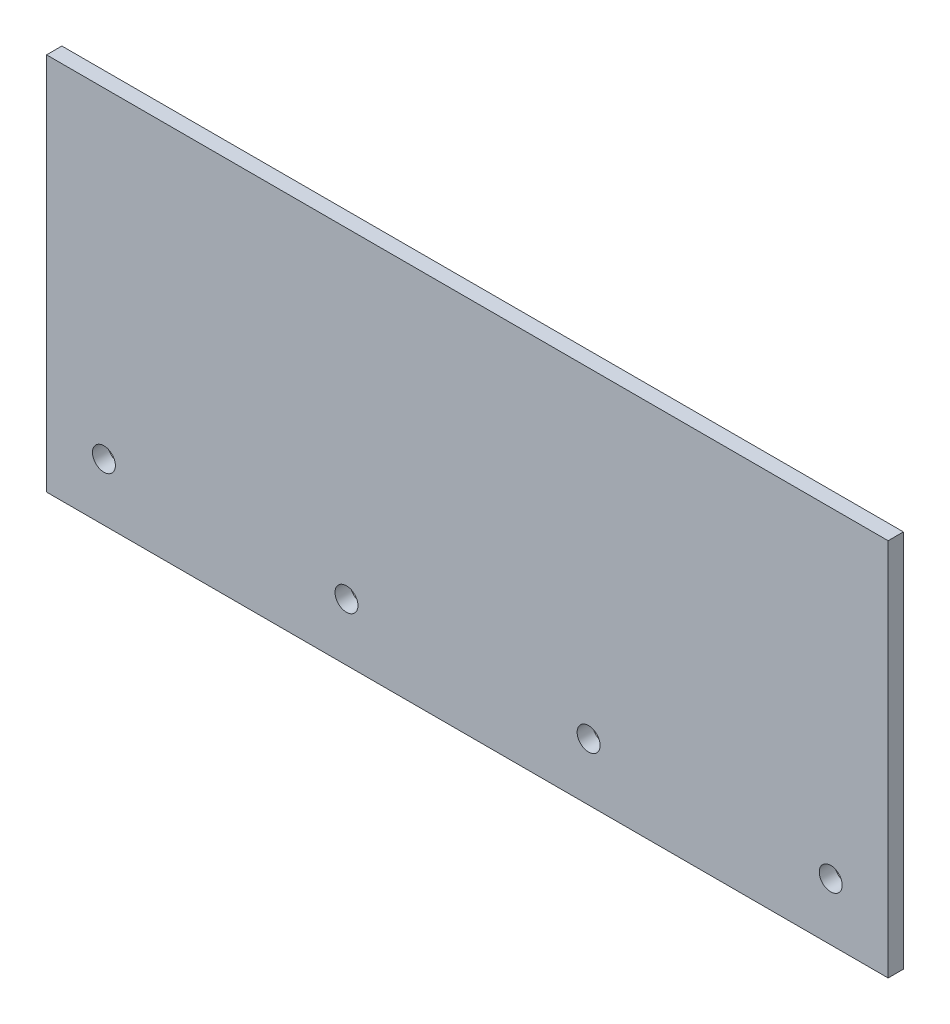
ISO-10303-21;
HEADER;
FILE_DESCRIPTION(('STEP AP214'),'2;1');
FILE_NAME('part.step','',(''),(''),'','','');
FILE_SCHEMA(('AUTOMOTIVE_DESIGN { 1 0 10303 214 1 1 1 1 }'));
ENDSEC;
DATA;
#1=APPLICATION_CONTEXT('core data for automotive mechanical design processes');
#2=APPLICATION_PROTOCOL_DEFINITION('international standard','automotive_design',2000,#1);
#3=PRODUCT_CONTEXT('',#1,'mechanical');
#4=PRODUCT('Part','Part','',(#3));
#5=PRODUCT_RELATED_PRODUCT_CATEGORY('part','',(#4));
#6=PRODUCT_DEFINITION_FORMATION('','',#4);
#7=PRODUCT_DEFINITION_CONTEXT('part definition',#1,'design');
#8=PRODUCT_DEFINITION('design','',#6,#7);
#9=PRODUCT_DEFINITION_SHAPE('','',#8);
#10=(LENGTH_UNIT() NAMED_UNIT(*) SI_UNIT(.MILLI.,.METRE.));
#11=(NAMED_UNIT(*) PLANE_ANGLE_UNIT() SI_UNIT($,.RADIAN.));
#12=(NAMED_UNIT(*) SI_UNIT($,.STERADIAN.) SOLID_ANGLE_UNIT());
#13=UNCERTAINTY_MEASURE_WITH_UNIT(LENGTH_MEASURE(1.E-05),#10,'distance_accuracy_value','');
#14=(GEOMETRIC_REPRESENTATION_CONTEXT(3) GLOBAL_UNCERTAINTY_ASSIGNED_CONTEXT((#13)) GLOBAL_UNIT_ASSIGNED_CONTEXT((#10,
#11,#12)) REPRESENTATION_CONTEXT('',''));
#15=CARTESIAN_POINT('',(0.,0.,0.));
#16=DIRECTION('',(0.,0.,1.));
#17=DIRECTION('',(1.,0.,0.));
#18=AXIS2_PLACEMENT_3D('',#15,#16,#17);
#19=CARTESIAN_POINT('',(0.,0.,4.));
#20=DIRECTION('',(0.,0.,-1.));
#21=DIRECTION('',(-1.,0.,0.));
#22=AXIS2_PLACEMENT_3D('',#19,#20,#21);
#23=PLANE('',#22);
#24=DIRECTION('',(0.,1.,0.));
#25=VECTOR('',#24,1.);
#26=CARTESIAN_POINT('',(220.,0.,4.));
#27=LINE('',#26,#25);
#28=CARTESIAN_POINT('',(220.,0.,4.));
#29=VERTEX_POINT('',#28);
#30=CARTESIAN_POINT('',(220.,99.,4.));
#31=VERTEX_POINT('',#30);
#32=EDGE_CURVE('E85',#29,#31,#27,.T.);
#33=ORIENTED_EDGE('',*,*,#32,.T.);
#34=DIRECTION('',(-1.,0.,0.));
#35=VECTOR('',#34,1.);
#36=CARTESIAN_POINT('',(0.,99.,4.));
#37=LINE('',#36,#35);
#38=CARTESIAN_POINT('',(0.,99.,4.));
#39=VERTEX_POINT('',#38);
#40=EDGE_CURVE('E80',#31,#39,#37,.T.);
#41=ORIENTED_EDGE('',*,*,#40,.T.);
#42=DIRECTION('',(0.,-1.,0.));
#43=VECTOR('',#42,1.);
#44=CARTESIAN_POINT('',(0.,99.,4.));
#45=LINE('',#44,#43);
#46=CARTESIAN_POINT('',(0.,0.,4.));
#47=VERTEX_POINT('',#46);
#48=EDGE_CURVE('E83',#39,#47,#45,.T.);
#49=ORIENTED_EDGE('',*,*,#48,.T.);
#50=DIRECTION('',(1.,0.,0.));
#51=VECTOR('',#50,1.);
#52=CARTESIAN_POINT('',(0.,0.,4.));
#53=LINE('',#52,#51);
#54=EDGE_CURVE('E50',#47,#29,#53,.T.);
#55=ORIENTED_EDGE('',*,*,#54,.T.);
#56=EDGE_LOOP('',(#33,#41,#49,#55));
#57=FACE_BOUND('',#56,.T.);
#58=CARTESIAN_POINT('',(205.,15.,4.));
#59=DIRECTION('',(0.,0.,1.));
#60=DIRECTION('',(1.,0.,0.));
#61=AXIS2_PLACEMENT_3D('',#58,#59,#60);
#62=CIRCLE('',#61,2.99999999999999);
#63=CARTESIAN_POINT('',(208.,15.,4.));
#64=VERTEX_POINT('',#63);
#65=EDGE_CURVE('E100',#64,#64,#62,.T.);
#66=ORIENTED_EDGE('',*,*,#65,.F.);
#67=EDGE_LOOP('',(#66));
#68=FACE_BOUND('',#67,.T.);
#69=CARTESIAN_POINT('',(15.,15.,4.));
#70=DIRECTION('',(0.,0.,1.));
#71=DIRECTION('',(1.,0.,0.));
#72=AXIS2_PLACEMENT_3D('',#69,#70,#71);
#73=CIRCLE('',#72,3.);
#74=CARTESIAN_POINT('',(18.,15.,4.));
#75=VERTEX_POINT('',#74);
#76=EDGE_CURVE('E115',#75,#75,#73,.T.);
#77=ORIENTED_EDGE('',*,*,#76,.F.);
#78=EDGE_LOOP('',(#77));
#79=FACE_BOUND('',#78,.T.);
#80=CARTESIAN_POINT('',(141.7,15.,4.));
#81=DIRECTION('',(0.,0.,1.));
#82=DIRECTION('',(1.,0.,0.));
#83=AXIS2_PLACEMENT_3D('',#80,#81,#82);
#84=CIRCLE('',#83,2.99999999999999);
#85=CARTESIAN_POINT('',(144.7,15.,4.));
#86=VERTEX_POINT('',#85);
#87=EDGE_CURVE('E121',#86,#86,#84,.T.);
#88=ORIENTED_EDGE('',*,*,#87,.F.);
#89=EDGE_LOOP('',(#88));
#90=FACE_BOUND('',#89,.T.);
#91=CARTESIAN_POINT('',(78.4000000000001,15.,4.));
#92=DIRECTION('',(0.,0.,1.));
#93=DIRECTION('',(1.,0.,0.));
#94=AXIS2_PLACEMENT_3D('',#91,#92,#93);
#95=CIRCLE('',#94,3.00000000000001);
#96=CARTESIAN_POINT('',(81.4000000000001,15.,4.));
#97=VERTEX_POINT('',#96);
#98=EDGE_CURVE('E127',#97,#97,#95,.T.);
#99=ORIENTED_EDGE('',*,*,#98,.F.);
#100=EDGE_LOOP('',(#99));
#101=FACE_BOUND('',#100,.T.);
#102=ADVANCED_FACE('F33',(#57,#68,#79,#90,#101),#23,.F.);
#103=CARTESIAN_POINT('',(0.,0.,0.));
#104=DIRECTION('',(0.,0.,-1.));
#105=DIRECTION('',(-1.,0.,0.));
#106=AXIS2_PLACEMENT_3D('',#103,#104,#105);
#107=PLANE('',#106);
#108=CARTESIAN_POINT('',(141.7,15.,0.));
#109=DIRECTION('',(0.,0.,1.));
#110=DIRECTION('',(1.,0.,0.));
#111=AXIS2_PLACEMENT_3D('',#108,#109,#110);
#112=CIRCLE('',#111,2.99999999999999);
#113=CARTESIAN_POINT('',(144.7,15.,0.));
#114=VERTEX_POINT('',#113);
#115=EDGE_CURVE('E124',#114,#114,#112,.T.);
#116=ORIENTED_EDGE('',*,*,#115,.T.);
#117=EDGE_LOOP('',(#116));
#118=FACE_BOUND('',#117,.T.);
#119=CARTESIAN_POINT('',(205.,15.,0.));
#120=DIRECTION('',(0.,0.,1.));
#121=DIRECTION('',(1.,0.,0.));
#122=AXIS2_PLACEMENT_3D('',#119,#120,#121);
#123=CIRCLE('',#122,2.99999999999999);
#124=CARTESIAN_POINT('',(208.,15.,0.));
#125=VERTEX_POINT('',#124);
#126=EDGE_CURVE('E112',#125,#125,#123,.T.);
#127=ORIENTED_EDGE('',*,*,#126,.T.);
#128=EDGE_LOOP('',(#127));
#129=FACE_BOUND('',#128,.T.);
#130=DIRECTION('',(0.,1.,0.));
#131=VECTOR('',#130,1.);
#132=CARTESIAN_POINT('',(220.,0.,0.));
#133=LINE('',#132,#131);
#134=CARTESIAN_POINT('',(220.,0.,0.));
#135=VERTEX_POINT('',#134);
#136=CARTESIAN_POINT('',(220.,99.,0.));
#137=VERTEX_POINT('',#136);
#138=EDGE_CURVE('E97',#135,#137,#133,.T.);
#139=ORIENTED_EDGE('',*,*,#138,.F.);
#140=DIRECTION('',(1.,0.,0.));
#141=VECTOR('',#140,1.);
#142=CARTESIAN_POINT('',(0.,0.,0.));
#143=LINE('',#142,#141);
#144=CARTESIAN_POINT('',(0.,0.,0.));
#145=VERTEX_POINT('',#144);
#146=EDGE_CURVE('E73',#145,#135,#143,.T.);
#147=ORIENTED_EDGE('',*,*,#146,.F.);
#148=DIRECTION('',(0.,-1.,0.));
#149=VECTOR('',#148,1.);
#150=CARTESIAN_POINT('',(0.,99.,0.));
#151=LINE('',#150,#149);
#152=CARTESIAN_POINT('',(0.,99.,0.));
#153=VERTEX_POINT('',#152);
#154=EDGE_CURVE('E67',#153,#145,#151,.T.);
#155=ORIENTED_EDGE('',*,*,#154,.F.);
#156=DIRECTION('',(-1.,0.,0.));
#157=VECTOR('',#156,1.);
#158=CARTESIAN_POINT('',(0.,99.,0.));
#159=LINE('',#158,#157);
#160=EDGE_CURVE('E89',#137,#153,#159,.T.);
#161=ORIENTED_EDGE('',*,*,#160,.F.);
#162=EDGE_LOOP('',(#139,#147,#155,#161));
#163=FACE_BOUND('',#162,.T.);
#164=CARTESIAN_POINT('',(15.,15.,0.));
#165=DIRECTION('',(0.,0.,1.));
#166=DIRECTION('',(1.,0.,0.));
#167=AXIS2_PLACEMENT_3D('',#164,#165,#166);
#168=CIRCLE('',#167,3.);
#169=CARTESIAN_POINT('',(18.,15.,0.));
#170=VERTEX_POINT('',#169);
#171=EDGE_CURVE('E118',#170,#170,#168,.T.);
#172=ORIENTED_EDGE('',*,*,#171,.T.);
#173=EDGE_LOOP('',(#172));
#174=FACE_BOUND('',#173,.T.);
#175=CARTESIAN_POINT('',(78.4000000000001,15.,0.));
#176=DIRECTION('',(0.,0.,1.));
#177=DIRECTION('',(1.,0.,0.));
#178=AXIS2_PLACEMENT_3D('',#175,#176,#177);
#179=CIRCLE('',#178,3.00000000000001);
#180=CARTESIAN_POINT('',(81.4000000000001,15.,0.));
#181=VERTEX_POINT('',#180);
#182=EDGE_CURVE('E130',#181,#181,#179,.T.);
#183=ORIENTED_EDGE('',*,*,#182,.T.);
#184=EDGE_LOOP('',(#183));
#185=FACE_BOUND('',#184,.T.);
#186=ADVANCED_FACE('F108',(#118,#129,#163,#174,#185),#107,.T.);
#187=CARTESIAN_POINT('',(220.,0.,4.));
#188=DIRECTION('',(-1.,0.,0.));
#189=DIRECTION('',(0.,-1.,0.));
#190=AXIS2_PLACEMENT_3D('',#187,#188,#189);
#191=PLANE('',#190);
#192=ORIENTED_EDGE('',*,*,#138,.T.);
#193=DIRECTION('',(0.,0.,-1.));
#194=VECTOR('',#193,1.);
#195=CARTESIAN_POINT('',(220.,99.,4.));
#196=LINE('',#195,#194);
#197=EDGE_CURVE('E11',#31,#137,#196,.T.);
#198=ORIENTED_EDGE('',*,*,#197,.F.);
#199=ORIENTED_EDGE('',*,*,#32,.F.);
#200=DIRECTION('',(0.,0.,-1.));
#201=VECTOR('',#200,1.);
#202=CARTESIAN_POINT('',(220.,0.,4.));
#203=LINE('',#202,#201);
#204=EDGE_CURVE('E93',#29,#135,#203,.T.);
#205=ORIENTED_EDGE('',*,*,#204,.T.);
#206=EDGE_LOOP('',(#192,#198,#199,#205));
#207=FACE_BOUND('',#206,.T.);
#208=ADVANCED_FACE('F35',(#207),#191,.F.);
#209=CARTESIAN_POINT('',(0.,99.,4.));
#210=DIRECTION('',(0.,-1.,0.));
#211=DIRECTION('',(0.,0.,-1.));
#212=AXIS2_PLACEMENT_3D('',#209,#210,#211);
#213=PLANE('',#212);
#214=ORIENTED_EDGE('',*,*,#160,.T.);
#215=DIRECTION('',(0.,0.,-1.));
#216=VECTOR('',#215,1.);
#217=CARTESIAN_POINT('',(0.,99.,4.));
#218=LINE('',#217,#216);
#219=EDGE_CURVE('E42',#39,#153,#218,.T.);
#220=ORIENTED_EDGE('',*,*,#219,.F.);
#221=ORIENTED_EDGE('',*,*,#40,.F.);
#222=ORIENTED_EDGE('',*,*,#197,.T.);
#223=EDGE_LOOP('',(#214,#220,#221,#222));
#224=FACE_BOUND('',#223,.T.);
#225=ADVANCED_FACE('F88',(#224),#213,.F.);
#226=CARTESIAN_POINT('',(0.,99.,4.));
#227=DIRECTION('',(1.,0.,0.));
#228=DIRECTION('',(0.,1.,0.));
#229=AXIS2_PLACEMENT_3D('',#226,#227,#228);
#230=PLANE('',#229);
#231=ORIENTED_EDGE('',*,*,#154,.T.);
#232=DIRECTION('',(0.,0.,-1.));
#233=VECTOR('',#232,1.);
#234=CARTESIAN_POINT('',(0.,0.,4.));
#235=LINE('',#234,#233);
#236=EDGE_CURVE('E90',#47,#145,#235,.T.);
#237=ORIENTED_EDGE('',*,*,#236,.F.);
#238=ORIENTED_EDGE('',*,*,#48,.F.);
#239=ORIENTED_EDGE('',*,*,#219,.T.);
#240=EDGE_LOOP('',(#231,#237,#238,#239));
#241=FACE_BOUND('',#240,.T.);
#242=ADVANCED_FACE('F91',(#241),#230,.F.);
#243=CARTESIAN_POINT('',(0.,0.,4.));
#244=DIRECTION('',(0.,1.,0.));
#245=DIRECTION('',(-1.,0.,0.));
#246=AXIS2_PLACEMENT_3D('',#243,#244,#245);
#247=PLANE('',#246);
#248=ORIENTED_EDGE('',*,*,#146,.T.);
#249=ORIENTED_EDGE('',*,*,#204,.F.);
#250=ORIENTED_EDGE('',*,*,#54,.F.);
#251=ORIENTED_EDGE('',*,*,#236,.T.);
#252=EDGE_LOOP('',(#248,#249,#250,#251));
#253=FACE_BOUND('',#252,.T.);
#254=ADVANCED_FACE('F105',(#253),#247,.F.);
#255=CARTESIAN_POINT('',(205.,15.,4.));
#256=DIRECTION('',(0.,0.,-1.));
#257=DIRECTION('',(-1.,0.,0.));
#258=AXIS2_PLACEMENT_3D('',#255,#256,#257);
#259=CYLINDRICAL_SURFACE('',#258,2.99999999999999);
#260=ORIENTED_EDGE('',*,*,#65,.T.);
#261=EDGE_LOOP('',(#260));
#262=FACE_BOUND('',#261,.T.);
#263=ORIENTED_EDGE('',*,*,#126,.F.);
#264=EDGE_LOOP('',(#263));
#265=FACE_BOUND('',#264,.T.);
#266=ADVANCED_FACE('F147',(#262,#265),#259,.F.);
#267=CARTESIAN_POINT('',(15.,15.,4.));
#268=DIRECTION('',(0.,0.,-1.));
#269=DIRECTION('',(-1.,0.,0.));
#270=AXIS2_PLACEMENT_3D('',#267,#268,#269);
#271=CYLINDRICAL_SURFACE('',#270,3.);
#272=ORIENTED_EDGE('',*,*,#76,.T.);
#273=EDGE_LOOP('',(#272));
#274=FACE_BOUND('',#273,.T.);
#275=ORIENTED_EDGE('',*,*,#171,.F.);
#276=EDGE_LOOP('',(#275));
#277=FACE_BOUND('',#276,.T.);
#278=ADVANCED_FACE('F193',(#274,#277),#271,.F.);
#279=CARTESIAN_POINT('',(141.7,15.,4.));
#280=DIRECTION('',(0.,0.,-1.));
#281=DIRECTION('',(-1.,0.,0.));
#282=AXIS2_PLACEMENT_3D('',#279,#280,#281);
#283=CYLINDRICAL_SURFACE('',#282,2.99999999999999);
#284=ORIENTED_EDGE('',*,*,#87,.T.);
#285=EDGE_LOOP('',(#284));
#286=FACE_BOUND('',#285,.T.);
#287=ORIENTED_EDGE('',*,*,#115,.F.);
#288=EDGE_LOOP('',(#287));
#289=FACE_BOUND('',#288,.T.);
#290=ADVANCED_FACE('F201',(#286,#289),#283,.F.);
#291=CARTESIAN_POINT('',(78.4000000000001,15.,4.));
#292=DIRECTION('',(0.,0.,-1.));
#293=DIRECTION('',(-1.,0.,0.));
#294=AXIS2_PLACEMENT_3D('',#291,#292,#293);
#295=CYLINDRICAL_SURFACE('',#294,3.00000000000001);
#296=ORIENTED_EDGE('',*,*,#98,.T.);
#297=EDGE_LOOP('',(#296));
#298=FACE_BOUND('',#297,.T.);
#299=ORIENTED_EDGE('',*,*,#182,.F.);
#300=EDGE_LOOP('',(#299));
#301=FACE_BOUND('',#300,.T.);
#302=ADVANCED_FACE('F136',(#298,#301),#295,.F.);
#303=CLOSED_SHELL('',(#102,#186,#208,#225,#242,#254,#266,#278,#290,#302));
#304=MANIFOLD_SOLID_BREP('B2',#303);
#305=ADVANCED_BREP_SHAPE_REPRESENTATION('',(#18,#304),#14);
#306=SHAPE_DEFINITION_REPRESENTATION(#9,#305);
ENDSEC;
END-ISO-10303-21;
